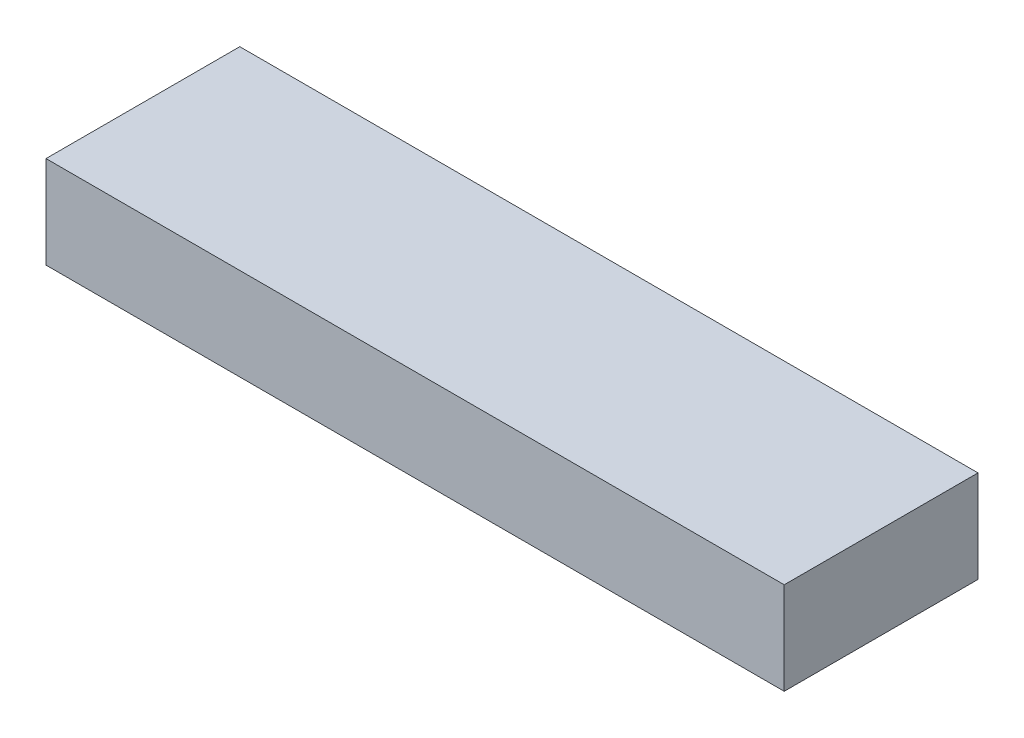
ISO-10303-21;
HEADER;
FILE_DESCRIPTION(('STEP AP214'),'2;1');
FILE_NAME('part.step','',(''),(''),'','','');
FILE_SCHEMA(('AUTOMOTIVE_DESIGN { 1 0 10303 214 1 1 1 1 }'));
ENDSEC;
DATA;
#1=APPLICATION_CONTEXT('core data for automotive mechanical design processes');
#2=APPLICATION_PROTOCOL_DEFINITION('international standard','automotive_design',2000,#1);
#3=PRODUCT_CONTEXT('',#1,'mechanical');
#4=PRODUCT('Part','Part','',(#3));
#5=PRODUCT_RELATED_PRODUCT_CATEGORY('part','',(#4));
#6=PRODUCT_DEFINITION_FORMATION('','',#4);
#7=PRODUCT_DEFINITION_CONTEXT('part definition',#1,'design');
#8=PRODUCT_DEFINITION('design','',#6,#7);
#9=PRODUCT_DEFINITION_SHAPE('','',#8);
#10=(LENGTH_UNIT() NAMED_UNIT(*) SI_UNIT(.MILLI.,.METRE.));
#11=(NAMED_UNIT(*) PLANE_ANGLE_UNIT() SI_UNIT($,.RADIAN.));
#12=(NAMED_UNIT(*) SI_UNIT($,.STERADIAN.) SOLID_ANGLE_UNIT());
#13=UNCERTAINTY_MEASURE_WITH_UNIT(LENGTH_MEASURE(1.E-05),#10,'distance_accuracy_value','');
#14=(GEOMETRIC_REPRESENTATION_CONTEXT(3) GLOBAL_UNCERTAINTY_ASSIGNED_CONTEXT((#13)) GLOBAL_UNIT_ASSIGNED_CONTEXT((#10,
#11,#12)) REPRESENTATION_CONTEXT('',''));
#15=CARTESIAN_POINT('',(0.,0.,0.));
#16=DIRECTION('',(0.,0.,1.));
#17=DIRECTION('',(1.,0.,0.));
#18=AXIS2_PLACEMENT_3D('',#15,#16,#17);
#19=CARTESIAN_POINT('',(40.,10.,-10.5));
#20=DIRECTION('',(-1.,0.,0.));
#21=DIRECTION('',(0.,0.,1.));
#22=AXIS2_PLACEMENT_3D('',#19,#20,#21);
#23=PLANE('',#22);
#24=DIRECTION('',(0.,0.,-1.));
#25=VECTOR('',#24,1.);
#26=CARTESIAN_POINT('',(40.,0.,-10.5));
#27=LINE('',#26,#25);
#28=CARTESIAN_POINT('',(40.,0.,10.5));
#29=VERTEX_POINT('',#28);
#30=CARTESIAN_POINT('',(40.,0.,-10.5));
#31=VERTEX_POINT('',#30);
#32=EDGE_CURVE('E100',#29,#31,#27,.T.);
#33=ORIENTED_EDGE('',*,*,#32,.T.);
#34=DIRECTION('',(0.,-1.,0.));
#35=VECTOR('',#34,1.);
#36=CARTESIAN_POINT('',(40.,10.,-10.5));
#37=LINE('',#36,#35);
#38=CARTESIAN_POINT('',(40.,10.,-10.5));
#39=VERTEX_POINT('',#38);
#40=EDGE_CURVE('E11',#39,#31,#37,.T.);
#41=ORIENTED_EDGE('',*,*,#40,.F.);
#42=DIRECTION('',(0.,0.,-1.));
#43=VECTOR('',#42,1.);
#44=CARTESIAN_POINT('',(40.,10.,-10.5));
#45=LINE('',#44,#43);
#46=CARTESIAN_POINT('',(40.,10.,10.5));
#47=VERTEX_POINT('',#46);
#48=EDGE_CURVE('E88',#47,#39,#45,.T.);
#49=ORIENTED_EDGE('',*,*,#48,.F.);
#50=DIRECTION('',(0.,-1.,0.));
#51=VECTOR('',#50,1.);
#52=CARTESIAN_POINT('',(40.,10.,10.5));
#53=LINE('',#52,#51);
#54=EDGE_CURVE('E96',#47,#29,#53,.T.);
#55=ORIENTED_EDGE('',*,*,#54,.T.);
#56=EDGE_LOOP('',(#33,#41,#49,#55));
#57=FACE_BOUND('',#56,.T.);
#58=ADVANCED_FACE('F37',(#57),#23,.F.);
#59=CARTESIAN_POINT('',(-40.,10.,-10.5));
#60=DIRECTION('',(0.,0.,1.));
#61=DIRECTION('',(1.,0.,0.));
#62=AXIS2_PLACEMENT_3D('',#59,#60,#61);
#63=PLANE('',#62);
#64=DIRECTION('',(-1.,0.,0.));
#65=VECTOR('',#64,1.);
#66=CARTESIAN_POINT('',(-40.,0.,-10.5));
#67=LINE('',#66,#65);
#68=CARTESIAN_POINT('',(-40.,0.,-10.5));
#69=VERTEX_POINT('',#68);
#70=EDGE_CURVE('E92',#31,#69,#67,.T.);
#71=ORIENTED_EDGE('',*,*,#70,.T.);
#72=DIRECTION('',(0.,-1.,0.));
#73=VECTOR('',#72,1.);
#74=CARTESIAN_POINT('',(-40.,10.,-10.5));
#75=LINE('',#74,#73);
#76=CARTESIAN_POINT('',(-40.,10.,-10.5));
#77=VERTEX_POINT('',#76);
#78=EDGE_CURVE('E45',#77,#69,#75,.T.);
#79=ORIENTED_EDGE('',*,*,#78,.F.);
#80=DIRECTION('',(-1.,0.,0.));
#81=VECTOR('',#80,1.);
#82=CARTESIAN_POINT('',(-40.,10.,-10.5));
#83=LINE('',#82,#81);
#84=EDGE_CURVE('E83',#39,#77,#83,.T.);
#85=ORIENTED_EDGE('',*,*,#84,.F.);
#86=ORIENTED_EDGE('',*,*,#40,.T.);
#87=EDGE_LOOP('',(#71,#79,#85,#86));
#88=FACE_BOUND('',#87,.T.);
#89=ADVANCED_FACE('F91',(#88),#63,.F.);
#90=CARTESIAN_POINT('',(-40.,10.,-10.5));
#91=DIRECTION('',(1.,0.,0.));
#92=DIRECTION('',(0.,0.,-1.));
#93=AXIS2_PLACEMENT_3D('',#90,#91,#92);
#94=PLANE('',#93);
#95=DIRECTION('',(0.,0.,1.));
#96=VECTOR('',#95,1.);
#97=CARTESIAN_POINT('',(-40.,0.,-10.5));
#98=LINE('',#97,#96);
#99=CARTESIAN_POINT('',(-40.,0.,10.5));
#100=VERTEX_POINT('',#99);
#101=EDGE_CURVE('E70',#69,#100,#98,.T.);
#102=ORIENTED_EDGE('',*,*,#101,.T.);
#103=DIRECTION('',(0.,-1.,0.));
#104=VECTOR('',#103,1.);
#105=CARTESIAN_POINT('',(-40.,10.,10.5));
#106=LINE('',#105,#104);
#107=CARTESIAN_POINT('',(-40.,10.,10.5));
#108=VERTEX_POINT('',#107);
#109=EDGE_CURVE('E93',#108,#100,#106,.T.);
#110=ORIENTED_EDGE('',*,*,#109,.F.);
#111=DIRECTION('',(0.,0.,1.));
#112=VECTOR('',#111,1.);
#113=CARTESIAN_POINT('',(-40.,10.,-10.5));
#114=LINE('',#113,#112);
#115=EDGE_CURVE('E86',#77,#108,#114,.T.);
#116=ORIENTED_EDGE('',*,*,#115,.F.);
#117=ORIENTED_EDGE('',*,*,#78,.T.);
#118=EDGE_LOOP('',(#102,#110,#116,#117));
#119=FACE_BOUND('',#118,.T.);
#120=ADVANCED_FACE('F94',(#119),#94,.F.);
#121=CARTESIAN_POINT('',(-40.,10.,10.5));
#122=DIRECTION('',(0.,0.,-1.));
#123=DIRECTION('',(-1.,0.,0.));
#124=AXIS2_PLACEMENT_3D('',#121,#122,#123);
#125=PLANE('',#124);
#126=DIRECTION('',(1.,0.,0.));
#127=VECTOR('',#126,1.);
#128=CARTESIAN_POINT('',(-40.,0.,10.5));
#129=LINE('',#128,#127);
#130=EDGE_CURVE('E76',#100,#29,#129,.T.);
#131=ORIENTED_EDGE('',*,*,#130,.T.);
#132=ORIENTED_EDGE('',*,*,#54,.F.);
#133=DIRECTION('',(1.,0.,0.));
#134=VECTOR('',#133,1.);
#135=CARTESIAN_POINT('',(-40.,10.,10.5));
#136=LINE('',#135,#134);
#137=EDGE_CURVE('E53',#108,#47,#136,.T.);
#138=ORIENTED_EDGE('',*,*,#137,.F.);
#139=ORIENTED_EDGE('',*,*,#109,.T.);
#140=EDGE_LOOP('',(#131,#132,#138,#139));
#141=FACE_BOUND('',#140,.T.);
#142=ADVANCED_FACE('F107',(#141),#125,.F.);
#143=CARTESIAN_POINT('',(0.,10.,0.));
#144=DIRECTION('',(0.,1.,0.));
#145=DIRECTION('',(0.,0.,1.));
#146=AXIS2_PLACEMENT_3D('',#143,#144,#145);
#147=PLANE('',#146);
#148=ORIENTED_EDGE('',*,*,#48,.T.);
#149=ORIENTED_EDGE('',*,*,#84,.T.);
#150=ORIENTED_EDGE('',*,*,#115,.T.);
#151=ORIENTED_EDGE('',*,*,#137,.T.);
#152=EDGE_LOOP('',(#148,#149,#150,#151));
#153=FACE_BOUND('',#152,.T.);
#154=ADVANCED_FACE('F84',(#153),#147,.T.);
#155=CARTESIAN_POINT('',(0.,0.,0.));
#156=DIRECTION('',(0.,1.,0.));
#157=DIRECTION('',(0.,0.,1.));
#158=AXIS2_PLACEMENT_3D('',#155,#156,#157);
#159=PLANE('',#158);
#160=ORIENTED_EDGE('',*,*,#32,.F.);
#161=ORIENTED_EDGE('',*,*,#130,.F.);
#162=ORIENTED_EDGE('',*,*,#101,.F.);
#163=ORIENTED_EDGE('',*,*,#70,.F.);
#164=EDGE_LOOP('',(#160,#161,#162,#163));
#165=FACE_BOUND('',#164,.T.);
#166=ADVANCED_FACE('F110',(#165),#159,.F.);
#167=CLOSED_SHELL('',(#58,#89,#120,#142,#154,#166));
#168=MANIFOLD_SOLID_BREP('B2',#167);
#169=ADVANCED_BREP_SHAPE_REPRESENTATION('',(#18,#168),#14);
#170=SHAPE_DEFINITION_REPRESENTATION(#9,#169);
ENDSEC;
END-ISO-10303-21;
